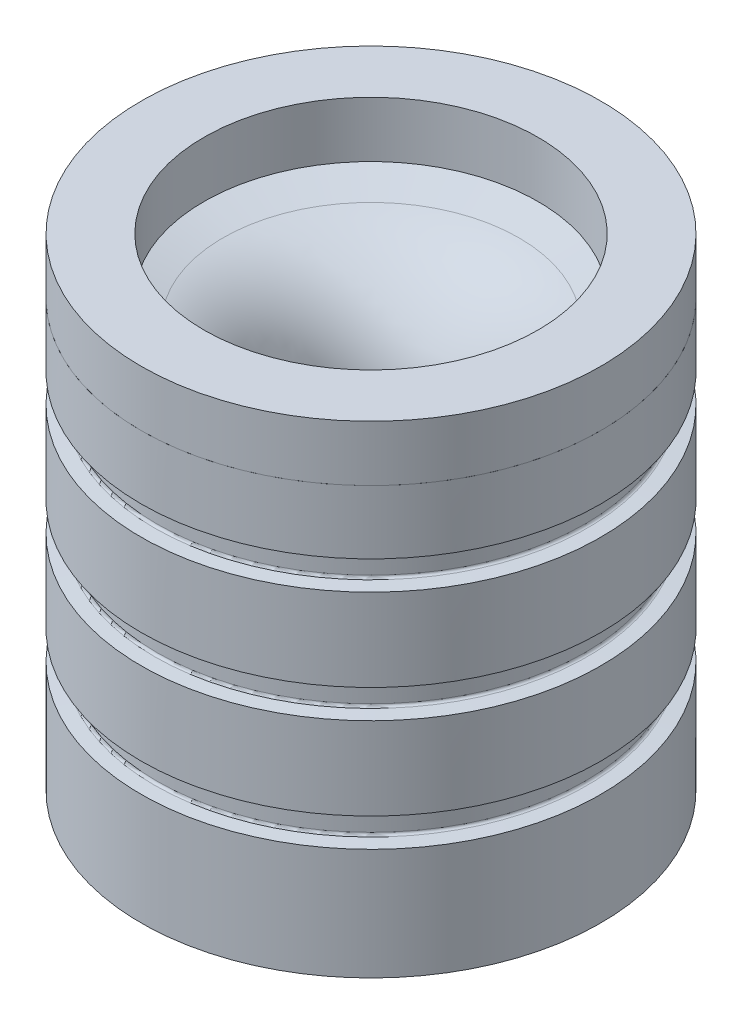
ISO-10303-21;
HEADER;
FILE_DESCRIPTION(('STEP AP214'),'2;1');
FILE_NAME('part.step','',(''),(''),'','','');
FILE_SCHEMA(('AUTOMOTIVE_DESIGN { 1 0 10303 214 1 1 1 1 }'));
ENDSEC;
DATA;
#1=APPLICATION_CONTEXT('core data for automotive mechanical design processes');
#2=APPLICATION_PROTOCOL_DEFINITION('international standard','automotive_design',2000,#1);
#3=PRODUCT_CONTEXT('',#1,'mechanical');
#4=PRODUCT('Part','Part','',(#3));
#5=PRODUCT_RELATED_PRODUCT_CATEGORY('part','',(#4));
#6=PRODUCT_DEFINITION_FORMATION('','',#4);
#7=PRODUCT_DEFINITION_CONTEXT('part definition',#1,'design');
#8=PRODUCT_DEFINITION('design','',#6,#7);
#9=PRODUCT_DEFINITION_SHAPE('','',#8);
#10=(LENGTH_UNIT() NAMED_UNIT(*) SI_UNIT(.MILLI.,.METRE.));
#11=(NAMED_UNIT(*) PLANE_ANGLE_UNIT() SI_UNIT($,.RADIAN.));
#12=(NAMED_UNIT(*) SI_UNIT($,.STERADIAN.) SOLID_ANGLE_UNIT());
#13=UNCERTAINTY_MEASURE_WITH_UNIT(LENGTH_MEASURE(1.E-05),#10,'distance_accuracy_value','');
#14=(GEOMETRIC_REPRESENTATION_CONTEXT(3) GLOBAL_UNCERTAINTY_ASSIGNED_CONTEXT((#13)) GLOBAL_UNIT_ASSIGNED_CONTEXT((#10,
#11,#12)) REPRESENTATION_CONTEXT('',''));
#15=CARTESIAN_POINT('',(0.,0.,0.));
#16=DIRECTION('',(0.,0.,1.));
#17=DIRECTION('',(1.,0.,0.));
#18=AXIS2_PLACEMENT_3D('',#15,#16,#17);
#19=CARTESIAN_POINT('',(-1.06121710792187,56.9306806065438,20.7106355573631));
#20=DIRECTION('',(0.,1.,0.));
#21=DIRECTION('',(0.,0.,1.));
#22=AXIS2_PLACEMENT_3D('',#19,#20,#21);
#23=PLANE('',#22);
#24=CARTESIAN_POINT('',(-1.06121710792187,56.9306806065438,20.7106355573631));
#25=DIRECTION('',(0.,1.,0.));
#26=DIRECTION('',(0.,0.,1.));
#27=AXIS2_PLACEMENT_3D('',#24,#25,#26);
#28=CIRCLE('',#27,41.275);
#29=CARTESIAN_POINT('',(-1.06121710792187,56.9306806065438,61.9856355573631));
#30=VERTEX_POINT('',#29);
#31=EDGE_CURVE('E11',#30,#30,#28,.T.);
#32=ORIENTED_EDGE('',*,*,#31,.T.);
#33=EDGE_LOOP('',(#32));
#34=FACE_BOUND('',#33,.T.);
#35=CARTESIAN_POINT('',(-1.06121710792187,56.9306806065438,20.7106355573631));
#36=DIRECTION('',(0.,1.,0.));
#37=DIRECTION('',(0.,0.,1.));
#38=AXIS2_PLACEMENT_3D('',#35,#36,#37);
#39=CIRCLE('',#38,30.);
#40=CARTESIAN_POINT('',(-1.06121710792187,56.9306806065438,50.7106355573631));
#41=VERTEX_POINT('',#40);
#42=EDGE_CURVE('E63',#41,#41,#39,.T.);
#43=ORIENTED_EDGE('',*,*,#42,.F.);
#44=EDGE_LOOP('',(#43));
#45=FACE_BOUND('',#44,.T.);
#46=ADVANCED_FACE('F52',(#34,#45),#23,.T.);
#47=CARTESIAN_POINT('',(-1.06121710792187,46.9306806065438,20.7106355573631));
#48=DIRECTION('',(0.,1.,0.));
#49=DIRECTION('',(0.,0.,1.));
#50=AXIS2_PLACEMENT_3D('',#47,#48,#49);
#51=PLANE('',#50);
#52=CARTESIAN_POINT('',(-1.06121710792187,46.9306806065438,20.7106355573631));
#53=DIRECTION('',(0.,1.,0.));
#54=DIRECTION('',(0.,0.,1.));
#55=AXIS2_PLACEMENT_3D('',#52,#53,#54);
#56=CIRCLE('',#55,41.275);
#57=CARTESIAN_POINT('',(-1.06121710792187,46.9306806065438,61.9856355573631));
#58=VERTEX_POINT('',#57);
#59=EDGE_CURVE('E56',#58,#58,#56,.T.);
#60=ORIENTED_EDGE('',*,*,#59,.F.);
#61=EDGE_LOOP('',(#60));
#62=FACE_BOUND('',#61,.T.);
#63=CARTESIAN_POINT('',(-1.06121710792187,46.9306806065438,20.7106355573631));
#64=DIRECTION('',(0.,1.,0.));
#65=DIRECTION('',(0.,0.,1.));
#66=AXIS2_PLACEMENT_3D('',#63,#64,#65);
#67=CIRCLE('',#66,30.);
#68=CARTESIAN_POINT('',(-1.06121710792187,46.9306806065438,50.7106355573631));
#69=VERTEX_POINT('',#68);
#70=EDGE_CURVE('E65',#69,#69,#67,.T.);
#71=ORIENTED_EDGE('',*,*,#70,.T.);
#72=EDGE_LOOP('',(#71));
#73=FACE_BOUND('',#72,.T.);
#74=ADVANCED_FACE('F75',(#62,#73),#51,.F.);
#75=CARTESIAN_POINT('',(-1.06121710792187,56.9306806065438,20.7106355573631));
#76=DIRECTION('',(0.,-1.,0.));
#77=DIRECTION('',(0.,0.,-1.));
#78=AXIS2_PLACEMENT_3D('',#75,#76,#77);
#79=CYLINDRICAL_SURFACE('',#78,41.275);
#80=ORIENTED_EDGE('',*,*,#31,.F.);
#81=EDGE_LOOP('',(#80));
#82=FACE_BOUND('',#81,.T.);
#83=ORIENTED_EDGE('',*,*,#59,.T.);
#84=EDGE_LOOP('',(#83));
#85=FACE_BOUND('',#84,.T.);
#86=ADVANCED_FACE('F54',(#82,#85),#79,.T.);
#87=CARTESIAN_POINT('',(-1.06121710792187,56.9306806065438,20.7106355573631));
#88=DIRECTION('',(0.,-1.,0.));
#89=DIRECTION('',(0.,0.,-1.));
#90=AXIS2_PLACEMENT_3D('',#87,#88,#89);
#91=CYLINDRICAL_SURFACE('',#90,30.);
#92=ORIENTED_EDGE('',*,*,#42,.T.);
#93=EDGE_LOOP('',(#92));
#94=FACE_BOUND('',#93,.T.);
#95=ORIENTED_EDGE('',*,*,#70,.F.);
#96=EDGE_LOOP('',(#95));
#97=FACE_BOUND('',#96,.T.);
#98=ADVANCED_FACE('F71',(#94,#97),#91,.F.);
#99=CLOSED_SHELL('',(#46,#74,#86,#98));
#100=MANIFOLD_SOLID_BREP('B2',#99);
#101=CARTESIAN_POINT('',(-1.06121710792187,-18.4562304365245,20.7106355573631));
#102=DIRECTION('',(0.,-1.,0.));
#103=DIRECTION('',(0.,0.,-1.));
#104=AXIS2_PLACEMENT_3D('',#101,#102,#103);
#105=CYLINDRICAL_SURFACE('',#104,41.275);
#106=CARTESIAN_POINT('',(-1.06121710792187,30.3476607315037,20.7106355573631));
#107=DIRECTION('',(0.,-1.,0.));
#108=DIRECTION('',(0.,0.,-1.));
#109=AXIS2_PLACEMENT_3D('',#106,#107,#108);
#110=CIRCLE('',#109,41.275);
#111=CARTESIAN_POINT('',(-1.06121710792187,30.3476607315037,-20.5643644426369));
#112=VERTEX_POINT('',#111);
#113=EDGE_CURVE('E122',#112,#112,#110,.F.);
#114=ORIENTED_EDGE('',*,*,#113,.F.);
#115=EDGE_LOOP('',(#114));
#116=FACE_BOUND('',#115,.T.);
#117=CARTESIAN_POINT('',(-1.06121710792187,15.5197931344917,20.7106355573631));
#118=DIRECTION('',(0.,1.,0.));
#119=DIRECTION('',(0.,0.,1.));
#120=AXIS2_PLACEMENT_3D('',#117,#118,#119);
#121=CIRCLE('',#120,41.275);
#122=CARTESIAN_POINT('',(-1.06121710792187,15.5197931344917,61.9856355573631));
#123=VERTEX_POINT('',#122);
#124=EDGE_CURVE('E180',#123,#123,#121,.F.);
#125=ORIENTED_EDGE('',*,*,#124,.F.);
#126=EDGE_LOOP('',(#125));
#127=FACE_BOUND('',#126,.T.);
#128=ADVANCED_FACE('F118',(#116,#127),#105,.T.);
#129=CARTESIAN_POINT('',(-1.06121710792187,10.3476607315037,20.7106355573631));
#130=DIRECTION('',(0.,-1.,0.));
#131=DIRECTION('',(0.,0.,-1.));
#132=AXIS2_PLACEMENT_3D('',#129,#130,#131);
#133=CIRCLE('',#132,41.275);
#134=CARTESIAN_POINT('',(-1.06121710792187,10.3476607315037,-20.5643644426369));
#135=VERTEX_POINT('',#134);
#136=EDGE_CURVE('E328',#135,#135,#133,.F.);
#137=ORIENTED_EDGE('',*,*,#136,.F.);
#138=EDGE_LOOP('',(#137));
#139=FACE_BOUND('',#138,.T.);
#140=CARTESIAN_POINT('',(-1.06121710792187,-4.48020686550835,20.7106355573631));
#141=DIRECTION('',(0.,1.,0.));
#142=DIRECTION('',(0.,0.,1.));
#143=AXIS2_PLACEMENT_3D('',#140,#141,#142);
#144=CIRCLE('',#143,41.275);
#145=CARTESIAN_POINT('',(-1.06121710792187,-4.48020686550835,61.9856355573631));
#146=VERTEX_POINT('',#145);
#147=EDGE_CURVE('E137',#146,#146,#144,.F.);
#148=ORIENTED_EDGE('',*,*,#147,.F.);
#149=EDGE_LOOP('',(#148));
#150=FACE_BOUND('',#149,.T.);
#151=ADVANCED_FACE('F234',(#139,#150),#105,.T.);
#152=CARTESIAN_POINT('',(-1.06121710792187,-9.65233926849626,20.7106355573631));
#153=DIRECTION('',(0.,-1.,0.));
#154=DIRECTION('',(0.,0.,-1.));
#155=AXIS2_PLACEMENT_3D('',#152,#153,#154);
#156=CIRCLE('',#155,41.275);
#157=CARTESIAN_POINT('',(-1.06121710792187,-9.65233926849626,-20.5643644426369));
#158=VERTEX_POINT('',#157);
#159=EDGE_CURVE('E150',#158,#158,#156,.F.);
#160=ORIENTED_EDGE('',*,*,#159,.F.);
#161=EDGE_LOOP('',(#160));
#162=FACE_BOUND('',#161,.T.);
#163=CARTESIAN_POINT('',(-1.06121710792187,-29.6601170106837,20.7106355573631));
#164=DIRECTION('',(0.,-1.,0.));
#165=DIRECTION('',(0.,0.,-1.));
#166=AXIS2_PLACEMENT_3D('',#163,#164,#165);
#167=CIRCLE('',#166,41.275);
#168=CARTESIAN_POINT('',(-1.06121710792187,-29.6601170106837,-20.5643644426369));
#169=VERTEX_POINT('',#168);
#170=EDGE_CURVE('E126',#169,#169,#167,.T.);
#171=ORIENTED_EDGE('',*,*,#170,.F.);
#172=EDGE_LOOP('',(#171));
#173=FACE_BOUND('',#172,.T.);
#174=ADVANCED_FACE('F240',(#162,#173),#105,.T.);
#175=CARTESIAN_POINT('',(-1.06121710792187,46.9306806065438,20.7106355573631));
#176=DIRECTION('',(0.,1.,0.));
#177=DIRECTION('',(0.,0.,1.));
#178=AXIS2_PLACEMENT_3D('',#175,#176,#177);
#179=CONICAL_SURFACE('',#178,41.275,1.30899693899575);
#180=CARTESIAN_POINT('',(-1.06121710792187,42.9934300840014,20.7106355573631));
#181=DIRECTION('',(0.,-1.,0.));
#182=DIRECTION('',(0.,0.,-1.));
#183=AXIS2_PLACEMENT_3D('',#180,#181,#182);
#184=CIRCLE('',#183,26.5809810077446);
#185=CARTESIAN_POINT('',(-1.06121710792187,42.9934300840014,-5.87034545038146));
#186=VERTEX_POINT('',#185);
#187=EDGE_CURVE('E144',#186,#186,#184,.T.);
#188=ORIENTED_EDGE('',*,*,#187,.T.);
#189=EDGE_LOOP('',(#188));
#190=FACE_BOUND('',#189,.T.);
#191=CARTESIAN_POINT('',(-1.06121710792187,46.9306806065438,20.7106355573631));
#192=DIRECTION('',(0.,-1.,0.));
#193=DIRECTION('',(0.,0.,-1.));
#194=AXIS2_PLACEMENT_3D('',#191,#192,#193);
#195=CIRCLE('',#194,41.275);
#196=CARTESIAN_POINT('',(-1.06121710792187,46.9306806065438,-20.5643644426369));
#197=VERTEX_POINT('',#196);
#198=EDGE_CURVE('E51',#197,#197,#195,.T.);
#199=ORIENTED_EDGE('',*,*,#198,.F.);
#200=EDGE_LOOP('',(#199));
#201=FACE_BOUND('',#200,.T.);
#202=ADVANCED_FACE('F120',(#190,#201),#179,.F.);
#203=CARTESIAN_POINT('',(-1.06121710792187,35.5197931344916,20.7106355573631));
#204=DIRECTION('',(0.,1.,0.));
#205=DIRECTION('',(0.,0.,1.));
#206=AXIS2_PLACEMENT_3D('',#203,#204,#205);
#207=CIRCLE('',#206,41.275);
#208=CARTESIAN_POINT('',(-1.06121710792187,35.5197931344916,61.9856355573631));
#209=VERTEX_POINT('',#208);
#210=EDGE_CURVE('E199',#209,#209,#207,.F.);
#211=ORIENTED_EDGE('',*,*,#210,.F.);
#212=EDGE_LOOP('',(#211));
#213=FACE_BOUND('',#212,.T.);
#214=ORIENTED_EDGE('',*,*,#198,.T.);
#215=EDGE_LOOP('',(#214));
#216=FACE_BOUND('',#215,.T.);
#217=ADVANCED_FACE('F236',(#213,#216),#105,.T.);
#218=CARTESIAN_POINT('',(40.2137828920781,-29.6601170106837,20.7106355573631));
#219=DIRECTION('',(0.,-1.,0.));
#220=DIRECTION('',(0.,0.,-1.));
#221=AXIS2_PLACEMENT_3D('',#218,#219,#220);
#222=PLANE('',#221);
#223=ORIENTED_EDGE('',*,*,#170,.T.);
#224=EDGE_LOOP('',(#223));
#225=FACE_BOUND('',#224,.T.);
#226=CARTESIAN_POINT('',(-1.06121710792187,-29.6601170106837,20.7106355573631));
#227=DIRECTION('',(0.,-1.,0.));
#228=DIRECTION('',(0.,0.,-1.));
#229=AXIS2_PLACEMENT_3D('',#226,#227,#228);
#230=CIRCLE('',#229,23.27236431);
#231=CARTESIAN_POINT('',(-1.06121710792187,-29.6601170106837,-2.56172875263688));
#232=VERTEX_POINT('',#231);
#233=EDGE_CURVE('E131',#232,#232,#230,.T.);
#234=ORIENTED_EDGE('',*,*,#233,.F.);
#235=EDGE_LOOP('',(#234));
#236=FACE_BOUND('',#235,.T.);
#237=ADVANCED_FACE('F246',(#225,#236),#222,.T.);
#238=CARTESIAN_POINT('',(-1.06121710792187,16.0490429133865,20.7106355573631));
#239=DIRECTION('',(0.,-1.,0.));
#240=DIRECTION('',(0.,0.,-1.));
#241=AXIS2_PLACEMENT_3D('',#238,#239,#240);
#242=CONICAL_SURFACE('',#241,11.0246318216405,0.261799387799147);
#243=ORIENTED_EDGE('',*,*,#233,.T.);
#244=EDGE_LOOP('',(#243));
#245=FACE_BOUND('',#244,.T.);
#246=CARTESIAN_POINT('',(-1.06121710792187,16.0490429133865,20.7106355573631));
#247=DIRECTION('',(0.,-1.,0.));
#248=DIRECTION('',(0.,0.,-1.));
#249=AXIS2_PLACEMENT_3D('',#246,#247,#248);
#250=CIRCLE('',#249,11.0246318216405);
#251=CARTESIAN_POINT('',(-1.06121710792187,16.0490429133865,9.68600373572264));
#252=VERTEX_POINT('',#251);
#253=EDGE_CURVE('E149',#252,#252,#250,.T.);
#254=ORIENTED_EDGE('',*,*,#253,.F.);
#255=EDGE_LOOP('',(#254));
#256=FACE_BOUND('',#255,.T.);
#257=ADVANCED_FACE('F252',(#245,#256),#242,.F.);
#258=CARTESIAN_POINT('',(-1.06121710792187,21.7430619056419,20.7106355573631));
#259=DIRECTION('',(0.,-1.,0.));
#260=DIRECTION('',(0.,0.,-1.));
#261=AXIS2_PLACEMENT_3D('',#258,#259,#260);
#262=TOROIDAL_SURFACE('',#261,32.275,22.);
#263=ORIENTED_EDGE('',*,*,#253,.T.);
#264=EDGE_LOOP('',(#263));
#265=FACE_BOUND('',#264,.T.);
#266=ORIENTED_EDGE('',*,*,#187,.F.);
#267=EDGE_LOOP('',(#266));
#268=FACE_BOUND('',#267,.T.);
#269=ADVANCED_FACE('F270',(#265,#268),#262,.T.);
#270=CARTESIAN_POINT('',(-1.06121710792187,-8.99836452370053,20.7106355573631));
#271=DIRECTION('',(0.,1.,0.));
#272=DIRECTION('',(0.,0.,1.));
#273=AXIS2_PLACEMENT_3D('',#270,#271,#272);
#274=TOROIDAL_SURFACE('',#273,38.9001,0.444499999999995);
#275=CARTESIAN_POINT('',(-1.06121710792187,-8.99836452370052,20.7106355573631));
#276=DIRECTION('',(0.,1.,0.));
#277=DIRECTION('',(0.,0.,1.));
#278=AXIS2_PLACEMENT_3D('',#275,#276,#277);
#279=CIRCLE('',#278,38.4556);
#280=CARTESIAN_POINT('',(-1.06121710792187,-8.99836452370052,59.1662355573631));
#281=VERTEX_POINT('',#280);
#282=EDGE_CURVE('E170',#281,#281,#279,.T.);
#283=ORIENTED_EDGE('',*,*,#282,.F.);
#284=EDGE_LOOP('',(#283));
#285=FACE_BOUND('',#284,.T.);
#286=CARTESIAN_POINT('',(-1.06121710792187,-9.4411730670023,20.7106355573631));
#287=DIRECTION('',(0.,1.,0.));
#288=DIRECTION('',(0.,0.,1.));
#289=AXIS2_PLACEMENT_3D('',#286,#287,#288);
#290=CIRCLE('',#289,38.8613592723487);
#291=CARTESIAN_POINT('',(-1.06121710792187,-9.4411730670023,59.5719948297118));
#292=VERTEX_POINT('',#291);
#293=EDGE_CURVE('E151',#292,#292,#290,.T.);
#294=ORIENTED_EDGE('',*,*,#293,.T.);
#295=EDGE_LOOP('',(#294));
#296=FACE_BOUND('',#295,.T.);
#297=ADVANCED_FACE('F276',(#285,#296),#274,.F.);
#298=CARTESIAN_POINT('',(-1.06121710792187,-9.66011701068371,20.7106355573631));
#299=DIRECTION('',(0.,-1.,0.));
#300=DIRECTION('',(0.,0.,-1.));
#301=AXIS2_PLACEMENT_3D('',#298,#299,#300);
#302=CONICAL_SURFACE('',#301,41.3639,1.48352986419518);
#303=ORIENTED_EDGE('',*,*,#159,.T.);
#304=EDGE_LOOP('',(#303));
#305=FACE_BOUND('',#304,.T.);
#306=ORIENTED_EDGE('',*,*,#293,.F.);
#307=EDGE_LOOP('',(#306));
#308=FACE_BOUND('',#307,.T.);
#309=ADVANCED_FACE('F283',(#305,#308),#302,.T.);
#310=CARTESIAN_POINT('',(-1.06121710792187,-4.69137306700231,20.7106355573631));
#311=DIRECTION('',(0.,1.,0.));
#312=DIRECTION('',(0.,0.,1.));
#313=AXIS2_PLACEMENT_3D('',#310,#311,#312);
#314=CONICAL_SURFACE('',#313,38.8613592723487,1.48352986419518);
#315=ORIENTED_EDGE('',*,*,#147,.T.);
#316=EDGE_LOOP('',(#315));
#317=FACE_BOUND('',#316,.T.);
#318=CARTESIAN_POINT('',(-1.06121710792187,-4.69137306700231,20.7106355573631));
#319=DIRECTION('',(0.,1.,0.));
#320=DIRECTION('',(0.,0.,1.));
#321=AXIS2_PLACEMENT_3D('',#318,#319,#320);
#322=CIRCLE('',#321,38.8613592723487);
#323=CARTESIAN_POINT('',(-1.06121710792187,-4.69137306700231,59.5719948297118));
#324=VERTEX_POINT('',#323);
#325=EDGE_CURVE('E163',#324,#324,#322,.T.);
#326=ORIENTED_EDGE('',*,*,#325,.T.);
#327=EDGE_LOOP('',(#326));
#328=FACE_BOUND('',#327,.T.);
#329=ADVANCED_FACE('F289',(#317,#328),#314,.T.);
#330=CARTESIAN_POINT('',(-1.06121710792187,-5.13418161030408,20.7106355573631));
#331=DIRECTION('',(0.,1.,0.));
#332=DIRECTION('',(0.,0.,1.));
#333=AXIS2_PLACEMENT_3D('',#330,#331,#332);
#334=TOROIDAL_SURFACE('',#333,38.9001,0.4445);
#335=ORIENTED_EDGE('',*,*,#325,.F.);
#336=EDGE_LOOP('',(#335));
#337=FACE_BOUND('',#336,.T.);
#338=CARTESIAN_POINT('',(-1.06121710792187,-5.13418161030409,20.7106355573631));
#339=DIRECTION('',(0.,1.,0.));
#340=DIRECTION('',(0.,0.,1.));
#341=AXIS2_PLACEMENT_3D('',#338,#339,#340);
#342=CIRCLE('',#341,38.4556);
#343=CARTESIAN_POINT('',(-1.06121710792187,-5.13418161030409,59.1662355573631));
#344=VERTEX_POINT('',#343);
#345=EDGE_CURVE('E167',#344,#344,#342,.T.);
#346=ORIENTED_EDGE('',*,*,#345,.T.);
#347=EDGE_LOOP('',(#346));
#348=FACE_BOUND('',#347,.T.);
#349=ADVANCED_FACE('F293',(#337,#348),#334,.F.);
#350=CARTESIAN_POINT('',(-1.06121710792187,-68.4562304365245,20.7106355573631));
#351=DIRECTION('',(0.,1.,0.));
#352=DIRECTION('',(0.,0.,1.));
#353=AXIS2_PLACEMENT_3D('',#350,#351,#352);
#354=CYLINDRICAL_SURFACE('',#353,38.4556);
#355=ORIENTED_EDGE('',*,*,#345,.F.);
#356=EDGE_LOOP('',(#355));
#357=FACE_BOUND('',#356,.T.);
#358=ORIENTED_EDGE('',*,*,#282,.T.);
#359=EDGE_LOOP('',(#358));
#360=FACE_BOUND('',#359,.T.);
#361=ADVANCED_FACE('F297',(#357,#360),#354,.T.);
#362=CARTESIAN_POINT('',(-1.06121710792187,11.0016354762995,20.7106355573631));
#363=DIRECTION('',(0.,1.,0.));
#364=DIRECTION('',(0.,0.,1.));
#365=AXIS2_PLACEMENT_3D('',#362,#363,#364);
#366=TOROIDAL_SURFACE('',#365,38.9001,0.444499999999995);
#367=CARTESIAN_POINT('',(-1.06121710792187,11.0016354762995,20.7106355573631));
#368=DIRECTION('',(0.,1.,0.));
#369=DIRECTION('',(0.,0.,1.));
#370=AXIS2_PLACEMENT_3D('',#367,#368,#369);
#371=CIRCLE('',#370,38.4556);
#372=CARTESIAN_POINT('',(-1.06121710792187,11.0016354762995,59.1662355573631));
#373=VERTEX_POINT('',#372);
#374=EDGE_CURVE('E189',#373,#373,#371,.T.);
#375=ORIENTED_EDGE('',*,*,#374,.F.);
#376=EDGE_LOOP('',(#375));
#377=FACE_BOUND('',#376,.T.);
#378=CARTESIAN_POINT('',(-1.06121710792187,10.5588269329977,20.7106355573631));
#379=DIRECTION('',(0.,1.,0.));
#380=DIRECTION('',(0.,0.,1.));
#381=AXIS2_PLACEMENT_3D('',#378,#379,#380);
#382=CIRCLE('',#381,38.8613592723487);
#383=CARTESIAN_POINT('',(-1.06121710792187,10.5588269329977,59.5719948297118));
#384=VERTEX_POINT('',#383);
#385=EDGE_CURVE('E177',#384,#384,#382,.T.);
#386=ORIENTED_EDGE('',*,*,#385,.T.);
#387=EDGE_LOOP('',(#386));
#388=FACE_BOUND('',#387,.T.);
#389=ADVANCED_FACE('F301',(#377,#388),#366,.F.);
#390=CARTESIAN_POINT('',(-1.06121710792187,10.3398829893163,20.7106355573631));
#391=DIRECTION('',(0.,-1.,0.));
#392=DIRECTION('',(0.,0.,-1.));
#393=AXIS2_PLACEMENT_3D('',#390,#391,#392);
#394=CONICAL_SURFACE('',#393,41.3639,1.48352986419518);
#395=ORIENTED_EDGE('',*,*,#136,.T.);
#396=EDGE_LOOP('',(#395));
#397=FACE_BOUND('',#396,.T.);
#398=ORIENTED_EDGE('',*,*,#385,.F.);
#399=EDGE_LOOP('',(#398));
#400=FACE_BOUND('',#399,.T.);
#401=ADVANCED_FACE('F305',(#397,#400),#394,.T.);
#402=CARTESIAN_POINT('',(-1.06121710792187,15.3086269329977,20.7106355573631));
#403=DIRECTION('',(0.,1.,0.));
#404=DIRECTION('',(0.,0.,1.));
#405=AXIS2_PLACEMENT_3D('',#402,#403,#404);
#406=CONICAL_SURFACE('',#405,38.8613592723487,1.48352986419518);
#407=ORIENTED_EDGE('',*,*,#124,.T.);
#408=EDGE_LOOP('',(#407));
#409=FACE_BOUND('',#408,.T.);
#410=CARTESIAN_POINT('',(-1.06121710792187,15.3086269329977,20.7106355573631));
#411=DIRECTION('',(0.,1.,0.));
#412=DIRECTION('',(0.,0.,1.));
#413=AXIS2_PLACEMENT_3D('',#410,#411,#412);
#414=CIRCLE('',#413,38.8613592723487);
#415=CARTESIAN_POINT('',(-1.06121710792187,15.3086269329977,59.5719948297118));
#416=VERTEX_POINT('',#415);
#417=EDGE_CURVE('E181',#416,#416,#414,.T.);
#418=ORIENTED_EDGE('',*,*,#417,.T.);
#419=EDGE_LOOP('',(#418));
#420=FACE_BOUND('',#419,.T.);
#421=ADVANCED_FACE('F309',(#409,#420),#406,.T.);
#422=CARTESIAN_POINT('',(-1.06121710792187,14.8658183896959,20.7106355573631));
#423=DIRECTION('',(0.,1.,0.));
#424=DIRECTION('',(0.,0.,1.));
#425=AXIS2_PLACEMENT_3D('',#422,#423,#424);
#426=TOROIDAL_SURFACE('',#425,38.9001,0.4445);
#427=ORIENTED_EDGE('',*,*,#417,.F.);
#428=EDGE_LOOP('',(#427));
#429=FACE_BOUND('',#428,.T.);
#430=CARTESIAN_POINT('',(-1.06121710792187,14.8658183896959,20.7106355573631));
#431=DIRECTION('',(0.,1.,0.));
#432=DIRECTION('',(0.,0.,1.));
#433=AXIS2_PLACEMENT_3D('',#430,#431,#432);
#434=CIRCLE('',#433,38.4556);
#435=CARTESIAN_POINT('',(-1.06121710792187,14.8658183896959,59.1662355573631));
#436=VERTEX_POINT('',#435);
#437=EDGE_CURVE('E185',#436,#436,#434,.T.);
#438=ORIENTED_EDGE('',*,*,#437,.T.);
#439=EDGE_LOOP('',(#438));
#440=FACE_BOUND('',#439,.T.);
#441=ADVANCED_FACE('F313',(#429,#440),#426,.F.);
#442=CARTESIAN_POINT('',(-1.06121710792187,-48.4562304365245,20.7106355573631));
#443=DIRECTION('',(0.,1.,0.));
#444=DIRECTION('',(0.,0.,1.));
#445=AXIS2_PLACEMENT_3D('',#442,#443,#444);
#446=CYLINDRICAL_SURFACE('',#445,38.4556);
#447=ORIENTED_EDGE('',*,*,#437,.F.);
#448=EDGE_LOOP('',(#447));
#449=FACE_BOUND('',#448,.T.);
#450=ORIENTED_EDGE('',*,*,#374,.T.);
#451=EDGE_LOOP('',(#450));
#452=FACE_BOUND('',#451,.T.);
#453=ADVANCED_FACE('F218',(#449,#452),#446,.T.);
#454=CARTESIAN_POINT('',(-1.06121710792187,31.0016354762995,20.7106355573631));
#455=DIRECTION('',(0.,1.,0.));
#456=DIRECTION('',(0.,0.,1.));
#457=AXIS2_PLACEMENT_3D('',#454,#455,#456);
#458=TOROIDAL_SURFACE('',#457,38.9001,0.444499999999995);
#459=CARTESIAN_POINT('',(-1.06121710792187,31.0016354762995,20.7106355573631));
#460=DIRECTION('',(0.,1.,0.));
#461=DIRECTION('',(0.,0.,1.));
#462=AXIS2_PLACEMENT_3D('',#459,#460,#461);
#463=CIRCLE('',#462,38.4556);
#464=CARTESIAN_POINT('',(-1.06121710792187,31.0016354762995,59.1662355573631));
#465=VERTEX_POINT('',#464);
#466=EDGE_CURVE('E207',#465,#465,#463,.T.);
#467=ORIENTED_EDGE('',*,*,#466,.F.);
#468=EDGE_LOOP('',(#467));
#469=FACE_BOUND('',#468,.T.);
#470=CARTESIAN_POINT('',(-1.06121710792187,30.5588269329977,20.7106355573631));
#471=DIRECTION('',(0.,1.,0.));
#472=DIRECTION('',(0.,0.,1.));
#473=AXIS2_PLACEMENT_3D('',#470,#471,#472);
#474=CIRCLE('',#473,38.8613592723487);
#475=CARTESIAN_POINT('',(-1.06121710792187,30.5588269329977,59.5719948297118));
#476=VERTEX_POINT('',#475);
#477=EDGE_CURVE('E196',#476,#476,#474,.T.);
#478=ORIENTED_EDGE('',*,*,#477,.T.);
#479=EDGE_LOOP('',(#478));
#480=FACE_BOUND('',#479,.T.);
#481=ADVANCED_FACE('F214',(#469,#480),#458,.F.);
#482=CARTESIAN_POINT('',(-1.06121710792187,30.3398829893163,20.7106355573631));
#483=DIRECTION('',(0.,-1.,0.));
#484=DIRECTION('',(0.,0.,-1.));
#485=AXIS2_PLACEMENT_3D('',#482,#483,#484);
#486=CONICAL_SURFACE('',#485,41.3639,1.48352986419518);
#487=ORIENTED_EDGE('',*,*,#113,.T.);
#488=EDGE_LOOP('',(#487));
#489=FACE_BOUND('',#488,.T.);
#490=ORIENTED_EDGE('',*,*,#477,.F.);
#491=EDGE_LOOP('',(#490));
#492=FACE_BOUND('',#491,.T.);
#493=ADVANCED_FACE('F217',(#489,#492),#486,.T.);
#494=CARTESIAN_POINT('',(-1.06121710792187,35.3086269329977,20.7106355573631));
#495=DIRECTION('',(0.,1.,0.));
#496=DIRECTION('',(0.,0.,1.));
#497=AXIS2_PLACEMENT_3D('',#494,#495,#496);
#498=CONICAL_SURFACE('',#497,38.8613592723487,1.48352986419518);
#499=ORIENTED_EDGE('',*,*,#210,.T.);
#500=EDGE_LOOP('',(#499));
#501=FACE_BOUND('',#500,.T.);
#502=CARTESIAN_POINT('',(-1.06121710792187,35.3086269329977,20.7106355573631));
#503=DIRECTION('',(0.,1.,0.));
#504=DIRECTION('',(0.,0.,1.));
#505=AXIS2_PLACEMENT_3D('',#502,#503,#504);
#506=CIRCLE('',#505,38.8613592723487);
#507=CARTESIAN_POINT('',(-1.06121710792187,35.3086269329977,59.5719948297118));
#508=VERTEX_POINT('',#507);
#509=EDGE_CURVE('E200',#508,#508,#506,.T.);
#510=ORIENTED_EDGE('',*,*,#509,.T.);
#511=EDGE_LOOP('',(#510));
#512=FACE_BOUND('',#511,.T.);
#513=ADVANCED_FACE('F223',(#501,#512),#498,.T.);
#514=CARTESIAN_POINT('',(-1.06121710792187,34.8658183896959,20.7106355573631));
#515=DIRECTION('',(0.,1.,0.));
#516=DIRECTION('',(0.,0.,1.));
#517=AXIS2_PLACEMENT_3D('',#514,#515,#516);
#518=TOROIDAL_SURFACE('',#517,38.9001,0.4445);
#519=ORIENTED_EDGE('',*,*,#509,.F.);
#520=EDGE_LOOP('',(#519));
#521=FACE_BOUND('',#520,.T.);
#522=CARTESIAN_POINT('',(-1.06121710792187,34.8658183896959,20.7106355573631));
#523=DIRECTION('',(0.,1.,0.));
#524=DIRECTION('',(0.,0.,1.));
#525=AXIS2_PLACEMENT_3D('',#522,#523,#524);
#526=CIRCLE('',#525,38.4556);
#527=CARTESIAN_POINT('',(-1.06121710792187,34.8658183896959,59.1662355573631));
#528=VERTEX_POINT('',#527);
#529=EDGE_CURVE('E203',#528,#528,#526,.T.);
#530=ORIENTED_EDGE('',*,*,#529,.T.);
#531=EDGE_LOOP('',(#530));
#532=FACE_BOUND('',#531,.T.);
#533=ADVANCED_FACE('F229',(#521,#532),#518,.F.);
#534=CARTESIAN_POINT('',(-1.06121710792187,-28.4562304365245,20.7106355573631));
#535=DIRECTION('',(0.,1.,0.));
#536=DIRECTION('',(0.,0.,1.));
#537=AXIS2_PLACEMENT_3D('',#534,#535,#536);
#538=CYLINDRICAL_SURFACE('',#537,38.4556);
#539=ORIENTED_EDGE('',*,*,#529,.F.);
#540=EDGE_LOOP('',(#539));
#541=FACE_BOUND('',#540,.T.);
#542=ORIENTED_EDGE('',*,*,#466,.T.);
#543=EDGE_LOOP('',(#542));
#544=FACE_BOUND('',#543,.T.);
#545=ADVANCED_FACE('F212',(#541,#544),#538,.T.);
#546=CLOSED_SHELL('',(#128,#151,#174,#202,#217,#237,#257,#269,#297,#309,#329,#349,#361,#389,
#401,#421,#441,#453,#481,#493,#513,#533,#545));
#547=MANIFOLD_SOLID_BREP('B6',#546);
#548=ADVANCED_BREP_SHAPE_REPRESENTATION('',(#18,#100,#547),#14);
#549=SHAPE_DEFINITION_REPRESENTATION(#9,#548);
ENDSEC;
END-ISO-10303-21;
